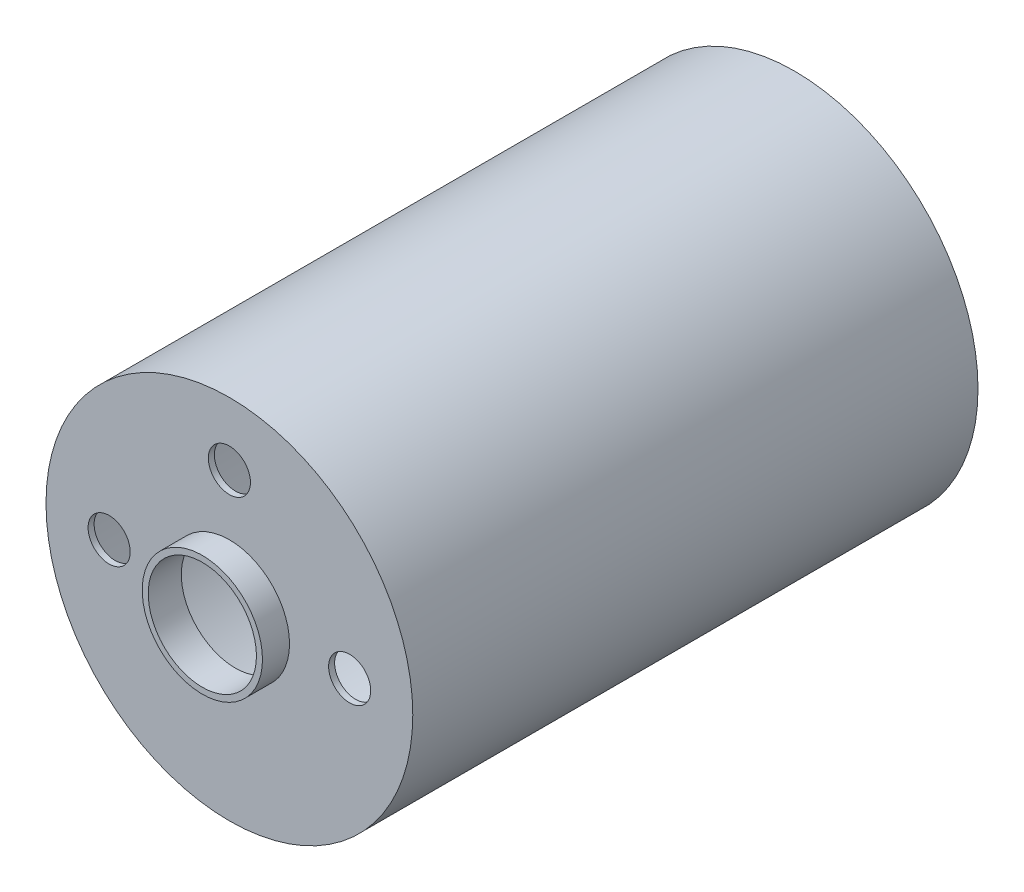
ISO-10303-21;
HEADER;
FILE_DESCRIPTION(('STEP AP214'),'2;1');
FILE_NAME('part.step','',(''),(''),'','','');
FILE_SCHEMA(('AUTOMOTIVE_DESIGN { 1 0 10303 214 1 1 1 1 }'));
ENDSEC;
DATA;
#1=APPLICATION_CONTEXT('core data for automotive mechanical design processes');
#2=APPLICATION_PROTOCOL_DEFINITION('international standard','automotive_design',2000,#1);
#3=PRODUCT_CONTEXT('',#1,'mechanical');
#4=PRODUCT('Part','Part','',(#3));
#5=PRODUCT_RELATED_PRODUCT_CATEGORY('part','',(#4));
#6=PRODUCT_DEFINITION_FORMATION('','',#4);
#7=PRODUCT_DEFINITION_CONTEXT('part definition',#1,'design');
#8=PRODUCT_DEFINITION('design','',#6,#7);
#9=PRODUCT_DEFINITION_SHAPE('','',#8);
#10=(LENGTH_UNIT() NAMED_UNIT(*) SI_UNIT(.MILLI.,.METRE.));
#11=(NAMED_UNIT(*) PLANE_ANGLE_UNIT() SI_UNIT($,.RADIAN.));
#12=(NAMED_UNIT(*) SI_UNIT($,.STERADIAN.) SOLID_ANGLE_UNIT());
#13=UNCERTAINTY_MEASURE_WITH_UNIT(LENGTH_MEASURE(1.E-05),#10,'distance_accuracy_value','');
#14=(GEOMETRIC_REPRESENTATION_CONTEXT(3) GLOBAL_UNCERTAINTY_ASSIGNED_CONTEXT((#13)) GLOBAL_UNIT_ASSIGNED_CONTEXT((#10,
#11,#12)) REPRESENTATION_CONTEXT('',''));
#15=CARTESIAN_POINT('',(0.,0.,0.));
#16=DIRECTION('',(0.,0.,1.));
#17=DIRECTION('',(1.,0.,0.));
#18=AXIS2_PLACEMENT_3D('',#15,#16,#17);
#19=CARTESIAN_POINT('',(0.,0.,23.5));
#20=DIRECTION('',(0.,0.,-1.));
#21=DIRECTION('',(-1.,0.,0.));
#22=AXIS2_PLACEMENT_3D('',#19,#20,#21);
#23=CYLINDRICAL_SURFACE('',#22,15.25);
#24=CARTESIAN_POINT('',(0.,0.,23.5));
#25=DIRECTION('',(0.,0.,1.));
#26=DIRECTION('',(1.,0.,0.));
#27=AXIS2_PLACEMENT_3D('',#24,#25,#26);
#28=CIRCLE('',#27,15.25);
#29=CARTESIAN_POINT('',(15.25,0.,23.5));
#30=VERTEX_POINT('',#29);
#31=EDGE_CURVE('E10',#30,#30,#28,.T.);
#32=ORIENTED_EDGE('',*,*,#31,.F.);
#33=EDGE_LOOP('',(#32));
#34=FACE_BOUND('',#33,.T.);
#35=CARTESIAN_POINT('',(0.,0.,-23.5));
#36=DIRECTION('',(0.,0.,1.));
#37=DIRECTION('',(1.,0.,0.));
#38=AXIS2_PLACEMENT_3D('',#35,#36,#37);
#39=CIRCLE('',#38,15.25);
#40=CARTESIAN_POINT('',(15.25,0.,-23.5));
#41=VERTEX_POINT('',#40);
#42=EDGE_CURVE('E46',#41,#41,#39,.T.);
#43=ORIENTED_EDGE('',*,*,#42,.T.);
#44=EDGE_LOOP('',(#43));
#45=FACE_BOUND('',#44,.T.);
#46=ADVANCED_FACE('F39',(#34,#45),#23,.T.);
#47=CARTESIAN_POINT('',(0.,0.,23.5));
#48=DIRECTION('',(0.,0.,1.));
#49=DIRECTION('',(1.,0.,0.));
#50=AXIS2_PLACEMENT_3D('',#47,#48,#49);
#51=PLANE('',#50);
#52=CARTESIAN_POINT('',(-10.,0.,23.5));
#53=DIRECTION('',(0.,0.,1.));
#54=DIRECTION('',(1.,0.,0.));
#55=AXIS2_PLACEMENT_3D('',#52,#53,#54);
#56=CIRCLE('',#55,1.75);
#57=CARTESIAN_POINT('',(-8.25,0.,23.5));
#58=VERTEX_POINT('',#57);
#59=EDGE_CURVE('E62',#58,#58,#56,.T.);
#60=ORIENTED_EDGE('',*,*,#59,.F.);
#61=EDGE_LOOP('',(#60));
#62=FACE_BOUND('',#61,.T.);
#63=CARTESIAN_POINT('',(0.,10.,23.5));
#64=DIRECTION('',(0.,0.,1.));
#65=DIRECTION('',(1.,0.,0.));
#66=AXIS2_PLACEMENT_3D('',#63,#64,#65);
#67=CIRCLE('',#66,1.75);
#68=CARTESIAN_POINT('',(1.75000000000003,10.,23.5));
#69=VERTEX_POINT('',#68);
#70=EDGE_CURVE('E86',#69,#69,#67,.T.);
#71=ORIENTED_EDGE('',*,*,#70,.F.);
#72=EDGE_LOOP('',(#71));
#73=FACE_BOUND('',#72,.T.);
#74=CARTESIAN_POINT('',(10.,0.,23.5));
#75=DIRECTION('',(0.,0.,1.));
#76=DIRECTION('',(1.,0.,0.));
#77=AXIS2_PLACEMENT_3D('',#74,#75,#76);
#78=CIRCLE('',#77,1.75);
#79=CARTESIAN_POINT('',(11.75,0.,23.5));
#80=VERTEX_POINT('',#79);
#81=EDGE_CURVE('E83',#80,#80,#78,.T.);
#82=ORIENTED_EDGE('',*,*,#81,.F.);
#83=EDGE_LOOP('',(#82));
#84=FACE_BOUND('',#83,.T.);
#85=CARTESIAN_POINT('',(0.,0.,23.5));
#86=DIRECTION('',(0.,0.,1.));
#87=DIRECTION('',(1.,0.,0.));
#88=AXIS2_PLACEMENT_3D('',#85,#86,#87);
#89=CIRCLE('',#88,5.);
#90=CARTESIAN_POINT('',(5.,0.,23.5));
#91=VERTEX_POINT('',#90);
#92=EDGE_CURVE('E51',#91,#91,#89,.F.);
#93=ORIENTED_EDGE('',*,*,#92,.T.);
#94=EDGE_LOOP('',(#93));
#95=FACE_BOUND('',#94,.T.);
#96=ORIENTED_EDGE('',*,*,#31,.T.);
#97=EDGE_LOOP('',(#96));
#98=FACE_BOUND('',#97,.T.);
#99=ADVANCED_FACE('F95',(#62,#73,#84,#95,#98),#51,.T.);
#100=CARTESIAN_POINT('',(0.,0.,-23.5));
#101=DIRECTION('',(0.,0.,1.));
#102=DIRECTION('',(1.,0.,0.));
#103=AXIS2_PLACEMENT_3D('',#100,#101,#102);
#104=PLANE('',#103);
#105=CARTESIAN_POINT('',(0.,0.,-23.5));
#106=DIRECTION('',(0.,0.,1.));
#107=DIRECTION('',(1.,0.,0.));
#108=AXIS2_PLACEMENT_3D('',#105,#106,#107);
#109=CIRCLE('',#108,14.75);
#110=CARTESIAN_POINT('',(14.75,0.,-23.5));
#111=VERTEX_POINT('',#110);
#112=EDGE_CURVE('E75',#111,#111,#109,.T.);
#113=ORIENTED_EDGE('',*,*,#112,.T.);
#114=EDGE_LOOP('',(#113));
#115=FACE_BOUND('',#114,.T.);
#116=ORIENTED_EDGE('',*,*,#42,.F.);
#117=EDGE_LOOP('',(#116));
#118=FACE_BOUND('',#117,.T.);
#119=ADVANCED_FACE('F98',(#115,#118),#104,.F.);
#120=CARTESIAN_POINT('',(0.,0.,25.75));
#121=DIRECTION('',(0.,0.,-1.));
#122=DIRECTION('',(-1.,0.,0.));
#123=AXIS2_PLACEMENT_3D('',#120,#121,#122);
#124=CYLINDRICAL_SURFACE('',#123,5.);
#125=ORIENTED_EDGE('',*,*,#92,.F.);
#126=EDGE_LOOP('',(#125));
#127=FACE_BOUND('',#126,.T.);
#128=CARTESIAN_POINT('',(0.,0.,25.75));
#129=DIRECTION('',(0.,0.,1.));
#130=DIRECTION('',(1.,0.,0.));
#131=AXIS2_PLACEMENT_3D('',#128,#129,#130);
#132=CIRCLE('',#131,5.);
#133=CARTESIAN_POINT('',(5.,0.,25.75));
#134=VERTEX_POINT('',#133);
#135=EDGE_CURVE('E54',#134,#134,#132,.T.);
#136=ORIENTED_EDGE('',*,*,#135,.F.);
#137=EDGE_LOOP('',(#136));
#138=FACE_BOUND('',#137,.T.);
#139=ADVANCED_FACE('F106',(#127,#138),#124,.T.);
#140=CARTESIAN_POINT('',(0.,0.,25.75));
#141=DIRECTION('',(0.,0.,1.));
#142=DIRECTION('',(1.,0.,0.));
#143=AXIS2_PLACEMENT_3D('',#140,#141,#142);
#144=PLANE('',#143);
#145=CARTESIAN_POINT('',(0.,0.,25.75));
#146=DIRECTION('',(0.,0.,1.));
#147=DIRECTION('',(1.,0.,0.));
#148=AXIS2_PLACEMENT_3D('',#145,#146,#147);
#149=CIRCLE('',#148,4.5);
#150=CARTESIAN_POINT('',(4.5,0.,25.75));
#151=VERTEX_POINT('',#150);
#152=EDGE_CURVE('E67',#151,#151,#149,.T.);
#153=ORIENTED_EDGE('',*,*,#152,.F.);
#154=EDGE_LOOP('',(#153));
#155=FACE_BOUND('',#154,.T.);
#156=ORIENTED_EDGE('',*,*,#135,.T.);
#157=EDGE_LOOP('',(#156));
#158=FACE_BOUND('',#157,.T.);
#159=ADVANCED_FACE('F109',(#155,#158),#144,.T.);
#160=CARTESIAN_POINT('',(0.,0.,23.5));
#161=DIRECTION('',(0.,0.,-1.));
#162=DIRECTION('',(-1.,0.,0.));
#163=AXIS2_PLACEMENT_3D('',#160,#161,#162);
#164=CYLINDRICAL_SURFACE('',#163,14.75);
#165=CARTESIAN_POINT('',(0.,0.,23.));
#166=DIRECTION('',(0.,0.,1.));
#167=DIRECTION('',(1.,0.,0.));
#168=AXIS2_PLACEMENT_3D('',#165,#166,#167);
#169=CIRCLE('',#168,14.75);
#170=CARTESIAN_POINT('',(14.75,0.,23.));
#171=VERTEX_POINT('',#170);
#172=EDGE_CURVE('E79',#171,#171,#169,.T.);
#173=ORIENTED_EDGE('',*,*,#172,.T.);
#174=EDGE_LOOP('',(#173));
#175=FACE_BOUND('',#174,.T.);
#176=ORIENTED_EDGE('',*,*,#112,.F.);
#177=EDGE_LOOP('',(#176));
#178=FACE_BOUND('',#177,.T.);
#179=ADVANCED_FACE('F115',(#175,#178),#164,.F.);
#180=CARTESIAN_POINT('',(0.,0.,23.));
#181=DIRECTION('',(0.,0.,1.));
#182=DIRECTION('',(1.,0.,0.));
#183=AXIS2_PLACEMENT_3D('',#180,#181,#182);
#184=PLANE('',#183);
#185=CARTESIAN_POINT('',(-10.,0.,23.));
#186=DIRECTION('',(0.,0.,1.));
#187=DIRECTION('',(1.,0.,0.));
#188=AXIS2_PLACEMENT_3D('',#185,#186,#187);
#189=CIRCLE('',#188,1.75);
#190=CARTESIAN_POINT('',(-8.25,0.,23.));
#191=VERTEX_POINT('',#190);
#192=EDGE_CURVE('E42',#191,#191,#189,.T.);
#193=ORIENTED_EDGE('',*,*,#192,.T.);
#194=EDGE_LOOP('',(#193));
#195=FACE_BOUND('',#194,.T.);
#196=CARTESIAN_POINT('',(0.,10.,23.));
#197=DIRECTION('',(0.,0.,1.));
#198=DIRECTION('',(1.,0.,0.));
#199=AXIS2_PLACEMENT_3D('',#196,#197,#198);
#200=CIRCLE('',#199,1.75);
#201=CARTESIAN_POINT('',(1.75000000000003,10.,23.));
#202=VERTEX_POINT('',#201);
#203=EDGE_CURVE('E61',#202,#202,#200,.T.);
#204=ORIENTED_EDGE('',*,*,#203,.T.);
#205=EDGE_LOOP('',(#204));
#206=FACE_BOUND('',#205,.T.);
#207=CARTESIAN_POINT('',(10.,0.,23.));
#208=DIRECTION('',(0.,0.,1.));
#209=DIRECTION('',(1.,0.,0.));
#210=AXIS2_PLACEMENT_3D('',#207,#208,#209);
#211=CIRCLE('',#210,1.75);
#212=CARTESIAN_POINT('',(11.75,0.,23.));
#213=VERTEX_POINT('',#212);
#214=EDGE_CURVE('E59',#213,#213,#211,.T.);
#215=ORIENTED_EDGE('',*,*,#214,.T.);
#216=EDGE_LOOP('',(#215));
#217=FACE_BOUND('',#216,.T.);
#218=CARTESIAN_POINT('',(0.,0.,23.));
#219=DIRECTION('',(0.,0.,1.));
#220=DIRECTION('',(1.,0.,0.));
#221=AXIS2_PLACEMENT_3D('',#218,#219,#220);
#222=CIRCLE('',#221,4.5);
#223=CARTESIAN_POINT('',(4.5,0.,23.));
#224=VERTEX_POINT('',#223);
#225=EDGE_CURVE('E71',#224,#224,#222,.F.);
#226=ORIENTED_EDGE('',*,*,#225,.F.);
#227=EDGE_LOOP('',(#226));
#228=FACE_BOUND('',#227,.T.);
#229=ORIENTED_EDGE('',*,*,#172,.F.);
#230=EDGE_LOOP('',(#229));
#231=FACE_BOUND('',#230,.T.);
#232=ADVANCED_FACE('F121',(#195,#206,#217,#228,#231),#184,.F.);
#233=CARTESIAN_POINT('',(0.,0.,25.75));
#234=DIRECTION('',(0.,0.,-1.));
#235=DIRECTION('',(-1.,0.,0.));
#236=AXIS2_PLACEMENT_3D('',#233,#234,#235);
#237=CYLINDRICAL_SURFACE('',#236,4.5);
#238=ORIENTED_EDGE('',*,*,#225,.T.);
#239=EDGE_LOOP('',(#238));
#240=FACE_BOUND('',#239,.T.);
#241=ORIENTED_EDGE('',*,*,#152,.T.);
#242=EDGE_LOOP('',(#241));
#243=FACE_BOUND('',#242,.T.);
#244=ADVANCED_FACE('F169',(#240,#243),#237,.F.);
#245=CARTESIAN_POINT('',(10.,0.,19.));
#246=DIRECTION('',(0.,0.,1.));
#247=DIRECTION('',(1.,0.,0.));
#248=AXIS2_PLACEMENT_3D('',#245,#246,#247);
#249=CYLINDRICAL_SURFACE('',#248,1.75);
#250=ORIENTED_EDGE('',*,*,#81,.T.);
#251=EDGE_LOOP('',(#250));
#252=FACE_BOUND('',#251,.T.);
#253=ORIENTED_EDGE('',*,*,#214,.F.);
#254=EDGE_LOOP('',(#253));
#255=FACE_BOUND('',#254,.T.);
#256=ADVANCED_FACE('F174',(#252,#255),#249,.F.);
#257=CARTESIAN_POINT('',(0.,10.,19.));
#258=DIRECTION('',(0.,0.,1.));
#259=DIRECTION('',(1.,0.,0.));
#260=AXIS2_PLACEMENT_3D('',#257,#258,#259);
#261=CYLINDRICAL_SURFACE('',#260,1.75);
#262=ORIENTED_EDGE('',*,*,#70,.T.);
#263=EDGE_LOOP('',(#262));
#264=FACE_BOUND('',#263,.T.);
#265=ORIENTED_EDGE('',*,*,#203,.F.);
#266=EDGE_LOOP('',(#265));
#267=FACE_BOUND('',#266,.T.);
#268=ADVANCED_FACE('F193',(#264,#267),#261,.F.);
#269=CARTESIAN_POINT('',(-10.,0.,19.));
#270=DIRECTION('',(0.,0.,1.));
#271=DIRECTION('',(1.,0.,0.));
#272=AXIS2_PLACEMENT_3D('',#269,#270,#271);
#273=CYLINDRICAL_SURFACE('',#272,1.75);
#274=ORIENTED_EDGE('',*,*,#59,.T.);
#275=EDGE_LOOP('',(#274));
#276=FACE_BOUND('',#275,.T.);
#277=ORIENTED_EDGE('',*,*,#192,.F.);
#278=EDGE_LOOP('',(#277));
#279=FACE_BOUND('',#278,.T.);
#280=ADVANCED_FACE('F92',(#276,#279),#273,.F.);
#281=CLOSED_SHELL('',(#46,#99,#119,#139,#159,#179,#232,#244,#256,#268,#280));
#282=MANIFOLD_SOLID_BREP('B2',#281);
#283=ADVANCED_BREP_SHAPE_REPRESENTATION('',(#18,#282),#14);
#284=SHAPE_DEFINITION_REPRESENTATION(#9,#283);
ENDSEC;
END-ISO-10303-21;
